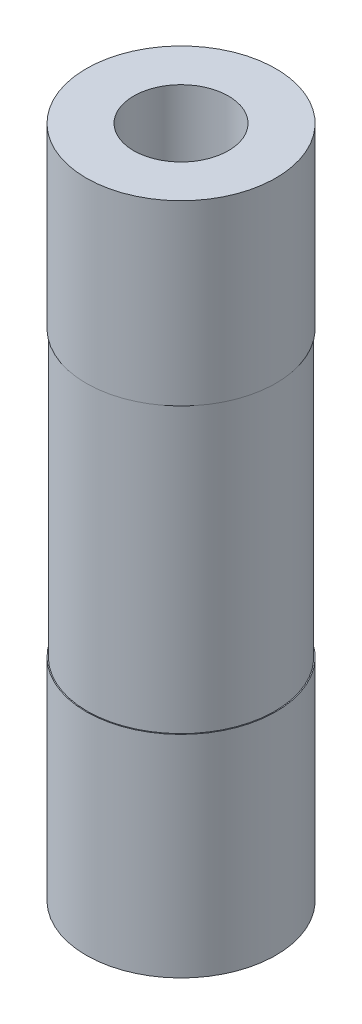
ISO-10303-21;
HEADER;
FILE_DESCRIPTION(('STEP AP214'),'2;1');
FILE_NAME('part.step','',(''),(''),'','','');
FILE_SCHEMA(('AUTOMOTIVE_DESIGN { 1 0 10303 214 1 1 1 1 }'));
ENDSEC;
DATA;
#1=APPLICATION_CONTEXT('core data for automotive mechanical design processes');
#2=APPLICATION_PROTOCOL_DEFINITION('international standard','automotive_design',2000,#1);
#3=PRODUCT_CONTEXT('',#1,'mechanical');
#4=PRODUCT('Part','Part','',(#3));
#5=PRODUCT_RELATED_PRODUCT_CATEGORY('part','',(#4));
#6=PRODUCT_DEFINITION_FORMATION('','',#4);
#7=PRODUCT_DEFINITION_CONTEXT('part definition',#1,'design');
#8=PRODUCT_DEFINITION('design','',#6,#7);
#9=PRODUCT_DEFINITION_SHAPE('','',#8);
#10=(LENGTH_UNIT() NAMED_UNIT(*) SI_UNIT(.MILLI.,.METRE.));
#11=(NAMED_UNIT(*) PLANE_ANGLE_UNIT() SI_UNIT($,.RADIAN.));
#12=(NAMED_UNIT(*) SI_UNIT($,.STERADIAN.) SOLID_ANGLE_UNIT());
#13=UNCERTAINTY_MEASURE_WITH_UNIT(LENGTH_MEASURE(1.E-05),#10,'distance_accuracy_value','');
#14=(GEOMETRIC_REPRESENTATION_CONTEXT(3) GLOBAL_UNCERTAINTY_ASSIGNED_CONTEXT((#13)) GLOBAL_UNIT_ASSIGNED_CONTEXT((#10,
#11,#12)) REPRESENTATION_CONTEXT('',''));
#15=CARTESIAN_POINT('',(0.,0.,0.));
#16=DIRECTION('',(0.,0.,1.));
#17=DIRECTION('',(1.,0.,0.));
#18=AXIS2_PLACEMENT_3D('',#15,#16,#17);
#19=CARTESIAN_POINT('',(0.,71.,0.));
#20=DIRECTION('',(0.,-1.,0.));
#21=DIRECTION('',(0.,0.,-1.));
#22=AXIS2_PLACEMENT_3D('',#19,#20,#21);
#23=CYLINDRICAL_SURFACE('',#22,10.);
#24=CARTESIAN_POINT('',(0.,71.,0.));
#25=DIRECTION('',(0.,1.,0.));
#26=DIRECTION('',(0.,0.,1.));
#27=AXIS2_PLACEMENT_3D('',#24,#25,#26);
#28=CIRCLE('',#27,10.);
#29=CARTESIAN_POINT('',(0.,71.,10.));
#30=VERTEX_POINT('',#29);
#31=EDGE_CURVE('E10',#30,#30,#28,.T.);
#32=ORIENTED_EDGE('',*,*,#31,.F.);
#33=EDGE_LOOP('',(#32));
#34=FACE_BOUND('',#33,.T.);
#35=CARTESIAN_POINT('',(0.,52.25,0.));
#36=DIRECTION('',(0.,1.,0.));
#37=DIRECTION('',(0.,0.,1.));
#38=AXIS2_PLACEMENT_3D('',#35,#36,#37);
#39=CIRCLE('',#38,9.99999999999998);
#40=CARTESIAN_POINT('',(0.,52.25,9.99999999999998));
#41=VERTEX_POINT('',#40);
#42=EDGE_CURVE('E46',#41,#41,#39,.T.);
#43=ORIENTED_EDGE('',*,*,#42,.T.);
#44=EDGE_LOOP('',(#43));
#45=FACE_BOUND('',#44,.T.);
#46=ADVANCED_FACE('F31',(#34,#45),#23,.T.);
#47=CARTESIAN_POINT('',(0.,0.,0.));
#48=DIRECTION('',(0.,1.,0.));
#49=DIRECTION('',(0.,0.,1.));
#50=AXIS2_PLACEMENT_3D('',#47,#48,#49);
#51=CIRCLE('',#50,10.);
#52=CARTESIAN_POINT('',(0.,0.,10.));
#53=VERTEX_POINT('',#52);
#54=EDGE_CURVE('E34',#53,#53,#51,.T.);
#55=ORIENTED_EDGE('',*,*,#54,.T.);
#56=EDGE_LOOP('',(#55));
#57=FACE_BOUND('',#56,.T.);
#58=CARTESIAN_POINT('',(0.,22.25,0.));
#59=DIRECTION('',(0.,1.,0.));
#60=DIRECTION('',(0.,0.,1.));
#61=AXIS2_PLACEMENT_3D('',#58,#59,#60);
#62=CIRCLE('',#61,10.);
#63=CARTESIAN_POINT('',(0.,22.25,10.));
#64=VERTEX_POINT('',#63);
#65=EDGE_CURVE('E57',#64,#64,#62,.T.);
#66=ORIENTED_EDGE('',*,*,#65,.F.);
#67=EDGE_LOOP('',(#66));
#68=FACE_BOUND('',#67,.T.);
#69=ADVANCED_FACE('F64',(#57,#68),#23,.T.);
#70=CARTESIAN_POINT('',(0.,71.,0.));
#71=DIRECTION('',(0.,1.,0.));
#72=DIRECTION('',(0.,0.,1.));
#73=AXIS2_PLACEMENT_3D('',#70,#71,#72);
#74=PLANE('',#73);
#75=CARTESIAN_POINT('',(0.,71.,0.));
#76=DIRECTION('',(0.,1.,0.));
#77=DIRECTION('',(0.,0.,1.));
#78=AXIS2_PLACEMENT_3D('',#75,#76,#77);
#79=CIRCLE('',#78,5.);
#80=CARTESIAN_POINT('',(0.,71.,5.));
#81=VERTEX_POINT('',#80);
#82=EDGE_CURVE('E43',#81,#81,#79,.T.);
#83=ORIENTED_EDGE('',*,*,#82,.F.);
#84=EDGE_LOOP('',(#83));
#85=FACE_BOUND('',#84,.T.);
#86=ORIENTED_EDGE('',*,*,#31,.T.);
#87=EDGE_LOOP('',(#86));
#88=FACE_BOUND('',#87,.T.);
#89=ADVANCED_FACE('F66',(#85,#88),#74,.T.);
#90=CARTESIAN_POINT('',(0.,0.,0.));
#91=DIRECTION('',(0.,1.,0.));
#92=DIRECTION('',(0.,0.,1.));
#93=AXIS2_PLACEMENT_3D('',#90,#91,#92);
#94=PLANE('',#93);
#95=CARTESIAN_POINT('',(0.,0.,0.));
#96=DIRECTION('',(0.,1.,0.));
#97=DIRECTION('',(0.,0.,1.));
#98=AXIS2_PLACEMENT_3D('',#95,#96,#97);
#99=CIRCLE('',#98,5.);
#100=CARTESIAN_POINT('',(0.,0.,5.));
#101=VERTEX_POINT('',#100);
#102=EDGE_CURVE('E41',#101,#101,#99,.T.);
#103=ORIENTED_EDGE('',*,*,#102,.T.);
#104=EDGE_LOOP('',(#103));
#105=FACE_BOUND('',#104,.T.);
#106=ORIENTED_EDGE('',*,*,#54,.F.);
#107=EDGE_LOOP('',(#106));
#108=FACE_BOUND('',#107,.T.);
#109=ADVANCED_FACE('F73',(#105,#108),#94,.F.);
#110=CARTESIAN_POINT('',(0.,0.,0.));
#111=DIRECTION('',(0.,1.,0.));
#112=DIRECTION('',(0.,0.,1.));
#113=AXIS2_PLACEMENT_3D('',#110,#111,#112);
#114=CYLINDRICAL_SURFACE('',#113,5.);
#115=ORIENTED_EDGE('',*,*,#102,.F.);
#116=EDGE_LOOP('',(#115));
#117=FACE_BOUND('',#116,.T.);
#118=ORIENTED_EDGE('',*,*,#82,.T.);
#119=EDGE_LOOP('',(#118));
#120=FACE_BOUND('',#119,.T.);
#121=ADVANCED_FACE('F80',(#117,#120),#114,.F.);
#122=CARTESIAN_POINT('',(0.,52.25,-9.99999999999998));
#123=DIRECTION('',(0.,-1.,0.));
#124=DIRECTION('',(0.,0.,-1.));
#125=AXIS2_PLACEMENT_3D('',#122,#123,#124);
#126=PLANE('',#125);
#127=CARTESIAN_POINT('',(0.,52.25,0.));
#128=DIRECTION('',(0.,1.,0.));
#129=DIRECTION('',(0.,0.,1.));
#130=AXIS2_PLACEMENT_3D('',#127,#128,#129);
#131=CIRCLE('',#130,9.9);
#132=CARTESIAN_POINT('',(0.,52.25,9.9));
#133=VERTEX_POINT('',#132);
#134=EDGE_CURVE('E51',#133,#133,#131,.T.);
#135=ORIENTED_EDGE('',*,*,#134,.T.);
#136=EDGE_LOOP('',(#135));
#137=FACE_BOUND('',#136,.T.);
#138=ORIENTED_EDGE('',*,*,#42,.F.);
#139=EDGE_LOOP('',(#138));
#140=FACE_BOUND('',#139,.T.);
#141=ADVANCED_FACE('F85',(#137,#140),#126,.T.);
#142=CARTESIAN_POINT('',(0.,71.,0.));
#143=DIRECTION('',(0.,1.,0.));
#144=DIRECTION('',(0.,0.,1.));
#145=AXIS2_PLACEMENT_3D('',#142,#143,#144);
#146=CYLINDRICAL_SURFACE('',#145,9.9);
#147=CARTESIAN_POINT('',(0.,22.25,0.));
#148=DIRECTION('',(0.,1.,0.));
#149=DIRECTION('',(0.,0.,1.));
#150=AXIS2_PLACEMENT_3D('',#147,#148,#149);
#151=CIRCLE('',#150,9.9);
#152=CARTESIAN_POINT('',(0.,22.25,9.9));
#153=VERTEX_POINT('',#152);
#154=EDGE_CURVE('E54',#153,#153,#151,.T.);
#155=ORIENTED_EDGE('',*,*,#154,.T.);
#156=EDGE_LOOP('',(#155));
#157=FACE_BOUND('',#156,.T.);
#158=ORIENTED_EDGE('',*,*,#134,.F.);
#159=EDGE_LOOP('',(#158));
#160=FACE_BOUND('',#159,.T.);
#161=ADVANCED_FACE('F91',(#157,#160),#146,.T.);
#162=CARTESIAN_POINT('',(0.,22.25,-10.));
#163=DIRECTION('',(0.,1.,0.));
#164=DIRECTION('',(0.,0.,1.));
#165=AXIS2_PLACEMENT_3D('',#162,#163,#164);
#166=PLANE('',#165);
#167=ORIENTED_EDGE('',*,*,#65,.T.);
#168=EDGE_LOOP('',(#167));
#169=FACE_BOUND('',#168,.T.);
#170=ORIENTED_EDGE('',*,*,#154,.F.);
#171=EDGE_LOOP('',(#170));
#172=FACE_BOUND('',#171,.T.);
#173=ADVANCED_FACE('F61',(#169,#172),#166,.T.);
#174=CLOSED_SHELL('',(#46,#69,#89,#109,#121,#141,#161,#173));
#175=MANIFOLD_SOLID_BREP('B2',#174);
#176=ADVANCED_BREP_SHAPE_REPRESENTATION('',(#18,#175),#14);
#177=SHAPE_DEFINITION_REPRESENTATION(#9,#176);
ENDSEC;
END-ISO-10303-21;
